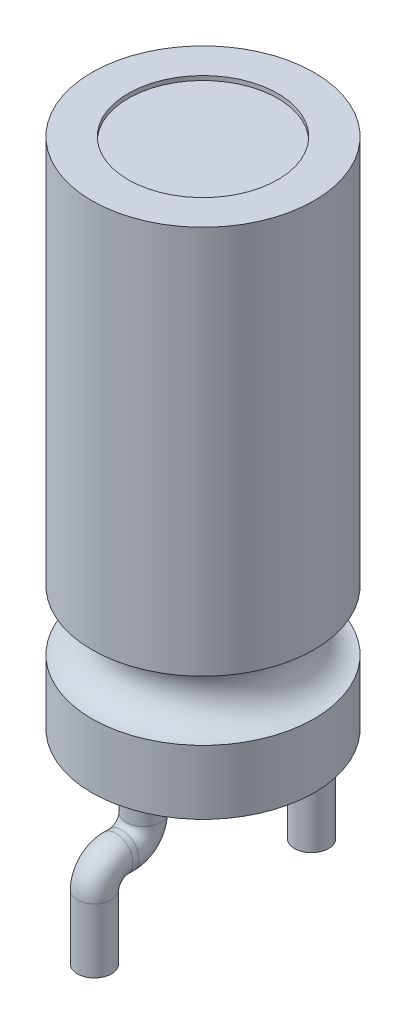
ISO-10303-21;
HEADER;
FILE_DESCRIPTION(('STEP AP214'),'2;1');
FILE_NAME('part.step','',(''),(''),'','','');
FILE_SCHEMA(('AUTOMOTIVE_DESIGN { 1 0 10303 214 1 1 1 1 }'));
ENDSEC;
DATA;
#1=APPLICATION_CONTEXT('core data for automotive mechanical design processes');
#2=APPLICATION_PROTOCOL_DEFINITION('international standard','automotive_design',2000,#1);
#3=PRODUCT_CONTEXT('',#1,'mechanical');
#4=PRODUCT('Part','Part','',(#3));
#5=PRODUCT_RELATED_PRODUCT_CATEGORY('part','',(#4));
#6=PRODUCT_DEFINITION_FORMATION('','',#4);
#7=PRODUCT_DEFINITION_CONTEXT('part definition',#1,'design');
#8=PRODUCT_DEFINITION('design','',#6,#7);
#9=PRODUCT_DEFINITION_SHAPE('','',#8);
#10=(LENGTH_UNIT() NAMED_UNIT(*) SI_UNIT(.MILLI.,.METRE.));
#11=(NAMED_UNIT(*) PLANE_ANGLE_UNIT() SI_UNIT($,.RADIAN.));
#12=(NAMED_UNIT(*) SI_UNIT($,.STERADIAN.) SOLID_ANGLE_UNIT());
#13=UNCERTAINTY_MEASURE_WITH_UNIT(LENGTH_MEASURE(1.E-05),#10,'distance_accuracy_value','');
#14=(GEOMETRIC_REPRESENTATION_CONTEXT(3) GLOBAL_UNCERTAINTY_ASSIGNED_CONTEXT((#13)) GLOBAL_UNIT_ASSIGNED_CONTEXT((#10,
#11,#12)) REPRESENTATION_CONTEXT('',''));
#15=CARTESIAN_POINT('',(0.,0.,0.));
#16=DIRECTION('',(0.,0.,1.));
#17=DIRECTION('',(1.,0.,0.));
#18=AXIS2_PLACEMENT_3D('',#15,#16,#17);
#19=CARTESIAN_POINT('',(2.6,27.5164236634825,0.));
#20=DIRECTION('',(0.,1.,0.));
#21=DIRECTION('',(0.,0.,1.));
#22=AXIS2_PLACEMENT_3D('',#19,#20,#21);
#23=PLANE('',#22);
#24=CARTESIAN_POINT('',(0.,27.5164236634825,1.4));
#25=DIRECTION('',(0.,-1.,0.));
#26=DIRECTION('',(0.,0.,-1.));
#27=AXIS2_PLACEMENT_3D('',#24,#25,#26);
#28=CIRCLE('',#27,0.4);
#29=CARTESIAN_POINT('',(0.,27.5164236634825,1.));
#30=VERTEX_POINT('',#29);
#31=EDGE_CURVE('E33',#30,#30,#28,.T.);
#32=ORIENTED_EDGE('',*,*,#31,.F.);
#33=EDGE_LOOP('',(#32));
#34=FACE_BOUND('',#33,.T.);
#35=CARTESIAN_POINT('',(0.,27.5164236634825,0.));
#36=DIRECTION('',(0.,1.,0.));
#37=DIRECTION('',(0.,0.,1.));
#38=AXIS2_PLACEMENT_3D('',#35,#36,#37);
#39=CIRCLE('',#38,2.6);
#40=CARTESIAN_POINT('',(0.,27.5164236634825,2.6));
#41=VERTEX_POINT('',#40);
#42=EDGE_CURVE('E29',#41,#41,#39,.T.);
#43=ORIENTED_EDGE('',*,*,#42,.F.);
#44=EDGE_LOOP('',(#43));
#45=FACE_BOUND('',#44,.T.);
#46=CARTESIAN_POINT('',(0.,27.5164236634825,-1.4));
#47=DIRECTION('',(0.,-1.,0.));
#48=DIRECTION('',(0.,0.,-1.));
#49=AXIS2_PLACEMENT_3D('',#46,#47,#48);
#50=CIRCLE('',#49,0.4);
#51=CARTESIAN_POINT('',(0.,27.5164236634825,-1.8));
#52=VERTEX_POINT('',#51);
#53=EDGE_CURVE('E10',#52,#52,#50,.T.);
#54=ORIENTED_EDGE('',*,*,#53,.F.);
#55=EDGE_LOOP('',(#54));
#56=FACE_BOUND('',#55,.T.);
#57=ADVANCED_FACE('F26',(#34,#45,#56),#23,.F.);
#58=CARTESIAN_POINT('',(0.,48.4017094017094,0.));
#59=DIRECTION('',(0.,1.,0.));
#60=DIRECTION('',(0.,0.,1.));
#61=AXIS2_PLACEMENT_3D('',#58,#59,#60);
#62=CYLINDRICAL_SURFACE('',#61,2.6);
#63=CARTESIAN_POINT('',(0.,29.0164236634825,0.));
#64=DIRECTION('',(0.,1.,0.));
#65=DIRECTION('',(0.,0.,1.));
#66=AXIS2_PLACEMENT_3D('',#63,#64,#65);
#67=CIRCLE('',#66,2.6);
#68=CARTESIAN_POINT('',(0.,29.0164236634825,2.6));
#69=VERTEX_POINT('',#68);
#70=EDGE_CURVE('E81',#69,#69,#67,.T.);
#71=ORIENTED_EDGE('',*,*,#70,.F.);
#72=EDGE_LOOP('',(#71));
#73=FACE_BOUND('',#72,.T.);
#74=ORIENTED_EDGE('',*,*,#42,.T.);
#75=EDGE_LOOP('',(#74));
#76=FACE_BOUND('',#75,.T.);
#77=ADVANCED_FACE('F88',(#73,#76),#62,.T.);
#78=CARTESIAN_POINT('',(0.,29.7164236634825,0.));
#79=DIRECTION('',(0.,1.,0.));
#80=DIRECTION('',(0.,0.,1.));
#81=AXIS2_PLACEMENT_3D('',#78,#79,#80);
#82=TOROIDAL_SURFACE('',#81,2.6,0.699999999999999);
#83=CARTESIAN_POINT('',(0.,30.4164236634825,0.));
#84=DIRECTION('',(0.,1.,0.));
#85=DIRECTION('',(0.,0.,1.));
#86=AXIS2_PLACEMENT_3D('',#83,#84,#85);
#87=CIRCLE('',#86,2.6);
#88=CARTESIAN_POINT('',(0.,30.4164236634825,2.6));
#89=VERTEX_POINT('',#88);
#90=EDGE_CURVE('E79',#89,#89,#87,.T.);
#91=ORIENTED_EDGE('',*,*,#90,.F.);
#92=EDGE_LOOP('',(#91));
#93=FACE_BOUND('',#92,.T.);
#94=ORIENTED_EDGE('',*,*,#70,.T.);
#95=EDGE_LOOP('',(#94));
#96=FACE_BOUND('',#95,.T.);
#97=ADVANCED_FACE('F96',(#93,#96),#82,.F.);
#98=CARTESIAN_POINT('',(0.,48.4017094017094,0.));
#99=DIRECTION('',(0.,1.,0.));
#100=DIRECTION('',(0.,0.,1.));
#101=AXIS2_PLACEMENT_3D('',#98,#99,#100);
#102=CYLINDRICAL_SURFACE('',#101,2.6);
#103=CARTESIAN_POINT('',(0.,39.5164236634825,0.));
#104=DIRECTION('',(0.,1.,0.));
#105=DIRECTION('',(0.,0.,1.));
#106=AXIS2_PLACEMENT_3D('',#103,#104,#105);
#107=CIRCLE('',#106,2.6);
#108=CARTESIAN_POINT('',(0.,39.5164236634825,2.6));
#109=VERTEX_POINT('',#108);
#110=EDGE_CURVE('E76',#109,#109,#107,.T.);
#111=ORIENTED_EDGE('',*,*,#110,.F.);
#112=EDGE_LOOP('',(#111));
#113=FACE_BOUND('',#112,.T.);
#114=ORIENTED_EDGE('',*,*,#90,.T.);
#115=EDGE_LOOP('',(#114));
#116=FACE_BOUND('',#115,.T.);
#117=ADVANCED_FACE('F141',(#113,#116),#102,.T.);
#118=CARTESIAN_POINT('',(0.,39.5164236634825,0.));
#119=DIRECTION('',(0.,-1.,0.));
#120=DIRECTION('',(0.,0.,-1.));
#121=AXIS2_PLACEMENT_3D('',#118,#119,#120);
#122=PLANE('',#121);
#123=CARTESIAN_POINT('',(0.,39.5164236634825,0.));
#124=DIRECTION('',(0.,1.,0.));
#125=DIRECTION('',(0.,0.,1.));
#126=AXIS2_PLACEMENT_3D('',#123,#124,#125);
#127=CIRCLE('',#126,1.75);
#128=CARTESIAN_POINT('',(0.,39.5164236634825,1.75));
#129=VERTEX_POINT('',#128);
#130=EDGE_CURVE('E70',#129,#129,#127,.T.);
#131=ORIENTED_EDGE('',*,*,#130,.F.);
#132=EDGE_LOOP('',(#131));
#133=FACE_BOUND('',#132,.T.);
#134=ORIENTED_EDGE('',*,*,#110,.T.);
#135=EDGE_LOOP('',(#134));
#136=FACE_BOUND('',#135,.T.);
#137=ADVANCED_FACE('F137',(#133,#136),#122,.F.);
#138=CARTESIAN_POINT('',(0.,39.4164236634825,0.));
#139=DIRECTION('',(0.,1.,0.));
#140=DIRECTION('',(0.,0.,1.));
#141=AXIS2_PLACEMENT_3D('',#138,#139,#140);
#142=CYLINDRICAL_SURFACE('',#141,1.75);
#143=CARTESIAN_POINT('',(0.,39.4164236634825,0.));
#144=DIRECTION('',(0.,1.,0.));
#145=DIRECTION('',(0.,0.,1.));
#146=AXIS2_PLACEMENT_3D('',#143,#144,#145);
#147=CIRCLE('',#146,1.75);
#148=CARTESIAN_POINT('',(0.,39.4164236634825,1.75));
#149=VERTEX_POINT('',#148);
#150=EDGE_CURVE('E73',#149,#149,#147,.T.);
#151=ORIENTED_EDGE('',*,*,#150,.F.);
#152=EDGE_LOOP('',(#151));
#153=FACE_BOUND('',#152,.T.);
#154=ORIENTED_EDGE('',*,*,#130,.T.);
#155=EDGE_LOOP('',(#154));
#156=FACE_BOUND('',#155,.T.);
#157=ADVANCED_FACE('F133',(#153,#156),#142,.F.);
#158=CARTESIAN_POINT('',(0.,39.4164236634825,0.));
#159=DIRECTION('',(0.,1.,0.));
#160=DIRECTION('',(0.,0.,1.));
#161=AXIS2_PLACEMENT_3D('',#158,#159,#160);
#162=PLANE('',#161);
#163=ORIENTED_EDGE('',*,*,#150,.T.);
#164=EDGE_LOOP('',(#163));
#165=FACE_BOUND('',#164,.T.);
#166=ADVANCED_FACE('F129',(#165),#162,.T.);
#167=CARTESIAN_POINT('',(0.,25.5164236634825,2.54));
#168=DIRECTION('',(0.,-1.,0.));
#169=DIRECTION('',(0.,0.,-1.));
#170=AXIS2_PLACEMENT_3D('',#167,#168,#169);
#171=CYLINDRICAL_SURFACE('',#170,0.4);
#172=CARTESIAN_POINT('',(0.,25.5164236634825,2.54));
#173=DIRECTION('',(0.,-1.,0.));
#174=DIRECTION('',(0.,0.,-1.));
#175=AXIS2_PLACEMENT_3D('',#172,#173,#174);
#176=CIRCLE('',#175,0.4);
#177=CARTESIAN_POINT('',(0.,25.5164236634825,2.94));
#178=VERTEX_POINT('',#177);
#179=EDGE_CURVE('E64',#178,#178,#176,.T.);
#180=ORIENTED_EDGE('',*,*,#179,.T.);
#181=EDGE_LOOP('',(#180));
#182=FACE_BOUND('',#181,.T.);
#183=CARTESIAN_POINT('',(0.,24.0164236634825,2.54));
#184=DIRECTION('',(0.,-1.,0.));
#185=DIRECTION('',(0.,0.,-1.));
#186=AXIS2_PLACEMENT_3D('',#183,#184,#185);
#187=CIRCLE('',#186,0.4);
#188=CARTESIAN_POINT('',(0.,24.0164236634825,2.14));
#189=VERTEX_POINT('',#188);
#190=EDGE_CURVE('E67',#189,#189,#187,.T.);
#191=ORIENTED_EDGE('',*,*,#190,.F.);
#192=EDGE_LOOP('',(#191));
#193=FACE_BOUND('',#192,.T.);
#194=ADVANCED_FACE('F125',(#182,#193),#171,.T.);
#195=CARTESIAN_POINT('',(0.,25.5164236634825,2.04));
#196=DIRECTION('',(1.,0.,0.));
#197=DIRECTION('',(0.,0.,-1.));
#198=AXIS2_PLACEMENT_3D('',#195,#196,#197);
#199=TOROIDAL_SURFACE('',#198,0.500000000000004,0.4);
#200=CARTESIAN_POINT('',(0.,26.0164236634825,2.04));
#201=DIRECTION('',(0.,0.,1.));
#202=DIRECTION('',(0.,-1.,0.));
#203=AXIS2_PLACEMENT_3D('',#200,#201,#202);
#204=CIRCLE('',#203,0.4);
#205=CARTESIAN_POINT('',(0.,26.4164236634825,2.03999999999999));
#206=VERTEX_POINT('',#205);
#207=EDGE_CURVE('E61',#206,#206,#204,.T.);
#208=CARTESIAN_POINT('',(0.,25.5164236634825,2.04));
#209=DIRECTION('',(1.,0.,0.));
#210=DIRECTION('',(0.,0.,-1.));
#211=AXIS2_PLACEMENT_3D('',#208,#209,#210);
#212=CIRCLE('',#211,0.900000000000004);
#213=EDGE_CURVE('',#206,#178,#212,.T.);
#214=ORIENTED_EDGE('',*,*,#207,.T.);
#215=ORIENTED_EDGE('',*,*,#179,.F.);
#216=ORIENTED_EDGE('',*,*,#213,.T.);
#217=ORIENTED_EDGE('',*,*,#213,.F.);
#218=EDGE_LOOP('',(#214,#216,#215,#217));
#219=FACE_BOUND('',#218,.T.);
#220=ADVANCED_FACE('F121',(#219),#199,.T.);
#221=CARTESIAN_POINT('',(0.,26.0164236634825,1.90000000000003));
#222=DIRECTION('',(0.,0.,1.));
#223=DIRECTION('',(1.,0.,0.));
#224=AXIS2_PLACEMENT_3D('',#221,#222,#223);
#225=CYLINDRICAL_SURFACE('',#224,0.4);
#226=CARTESIAN_POINT('',(0.,26.0164236634825,1.90000000000003));
#227=DIRECTION('',(0.,0.,1.));
#228=DIRECTION('',(0.,-1.,0.));
#229=AXIS2_PLACEMENT_3D('',#226,#227,#228);
#230=CIRCLE('',#229,0.4);
#231=CARTESIAN_POINT('',(0.,25.6164236634825,1.90000000000005));
#232=VERTEX_POINT('',#231);
#233=EDGE_CURVE('E58',#232,#232,#230,.T.);
#234=ORIENTED_EDGE('',*,*,#233,.T.);
#235=EDGE_LOOP('',(#234));
#236=FACE_BOUND('',#235,.T.);
#237=ORIENTED_EDGE('',*,*,#207,.F.);
#238=EDGE_LOOP('',(#237));
#239=FACE_BOUND('',#238,.T.);
#240=ADVANCED_FACE('F113',(#236,#239),#225,.T.);
#241=CARTESIAN_POINT('',(0.,26.5164236634825,1.9));
#242=DIRECTION('',(-1.,0.,0.));
#243=DIRECTION('',(0.,0.,1.));
#244=AXIS2_PLACEMENT_3D('',#241,#242,#243);
#245=TOROIDAL_SURFACE('',#244,0.5,0.4);
#246=CARTESIAN_POINT('',(0.,26.5164236634825,1.4));
#247=DIRECTION('',(0.,-1.,0.));
#248=DIRECTION('',(0.,0.,-1.));
#249=AXIS2_PLACEMENT_3D('',#246,#247,#248);
#250=CIRCLE('',#249,0.4);
#251=CARTESIAN_POINT('',(0.,26.5164236634825,1.));
#252=VERTEX_POINT('',#251);
#253=EDGE_CURVE('E54',#252,#252,#250,.T.);
#254=CARTESIAN_POINT('',(0.,26.5164236634825,1.9));
#255=DIRECTION('',(-1.,0.,0.));
#256=DIRECTION('',(0.,0.,1.));
#257=AXIS2_PLACEMENT_3D('',#254,#255,#256);
#258=CIRCLE('',#257,0.9);
#259=EDGE_CURVE('',#252,#232,#258,.T.);
#260=ORIENTED_EDGE('',*,*,#253,.T.);
#261=ORIENTED_EDGE('',*,*,#233,.F.);
#262=ORIENTED_EDGE('',*,*,#259,.T.);
#263=ORIENTED_EDGE('',*,*,#259,.F.);
#264=EDGE_LOOP('',(#260,#262,#261,#263));
#265=FACE_BOUND('',#264,.T.);
#266=ADVANCED_FACE('F103',(#265),#245,.T.);
#267=CARTESIAN_POINT('',(0.,26.5164236634825,1.4));
#268=DIRECTION('',(0.,1.,0.));
#269=DIRECTION('',(0.,0.,1.));
#270=AXIS2_PLACEMENT_3D('',#267,#268,#269);
#271=CYLINDRICAL_SURFACE('',#270,0.4);
#272=ORIENTED_EDGE('',*,*,#253,.F.);
#273=EDGE_LOOP('',(#272));
#274=FACE_BOUND('',#273,.T.);
#275=ORIENTED_EDGE('',*,*,#31,.T.);
#276=EDGE_LOOP('',(#275));
#277=FACE_BOUND('',#276,.T.);
#278=ADVANCED_FACE('F100',(#274,#277),#271,.T.);
#279=CARTESIAN_POINT('',(0.,24.0164236634825,2.54));
#280=DIRECTION('',(0.,-1.,0.));
#281=DIRECTION('',(0.,0.,-1.));
#282=AXIS2_PLACEMENT_3D('',#279,#280,#281);
#283=PLANE('',#282);
#284=ORIENTED_EDGE('',*,*,#190,.T.);
#285=EDGE_LOOP('',(#284));
#286=FACE_BOUND('',#285,.T.);
#287=ADVANCED_FACE('F102',(#286),#283,.T.);
#288=CARTESIAN_POINT('',(0.,25.5164236634825,-2.54));
#289=DIRECTION('',(0.,-1.,0.));
#290=DIRECTION('',(0.,0.,-1.));
#291=AXIS2_PLACEMENT_3D('',#288,#289,#290);
#292=CYLINDRICAL_SURFACE('',#291,0.4);
#293=CARTESIAN_POINT('',(0.,25.5164236634825,-2.54));
#294=DIRECTION('',(0.,-1.,0.));
#295=DIRECTION('',(0.,0.,-1.));
#296=AXIS2_PLACEMENT_3D('',#293,#294,#295);
#297=CIRCLE('',#296,0.4);
#298=CARTESIAN_POINT('',(0.,25.5164236634825,-2.94));
#299=VERTEX_POINT('',#298);
#300=EDGE_CURVE('E49',#299,#299,#297,.T.);
#301=ORIENTED_EDGE('',*,*,#300,.T.);
#302=EDGE_LOOP('',(#301));
#303=FACE_BOUND('',#302,.T.);
#304=CARTESIAN_POINT('',(0.,24.0164236634825,-2.54));
#305=DIRECTION('',(0.,-1.,0.));
#306=DIRECTION('',(0.,0.,-1.));
#307=AXIS2_PLACEMENT_3D('',#304,#305,#306);
#308=CIRCLE('',#307,0.4);
#309=CARTESIAN_POINT('',(0.,24.0164236634825,-2.94));
#310=VERTEX_POINT('',#309);
#311=EDGE_CURVE('E52',#310,#310,#308,.T.);
#312=ORIENTED_EDGE('',*,*,#311,.F.);
#313=EDGE_LOOP('',(#312));
#314=FACE_BOUND('',#313,.T.);
#315=ADVANCED_FACE('F110',(#303,#314),#292,.T.);
#316=CARTESIAN_POINT('',(0.,25.5164236634825,-2.04));
#317=DIRECTION('',(-1.,0.,0.));
#318=DIRECTION('',(0.,0.,1.));
#319=AXIS2_PLACEMENT_3D('',#316,#317,#318);
#320=TOROIDAL_SURFACE('',#319,0.500000000000004,0.4);
#321=CARTESIAN_POINT('',(0.,26.0164236634825,-2.03999999999999));
#322=DIRECTION('',(0.,0.,-1.));
#323=DIRECTION('',(0.,1.,0.));
#324=AXIS2_PLACEMENT_3D('',#321,#322,#323);
#325=CIRCLE('',#324,0.4);
#326=CARTESIAN_POINT('',(0.,26.4164236634825,-2.03999999999999));
#327=VERTEX_POINT('',#326);
#328=EDGE_CURVE('E46',#327,#327,#325,.T.);
#329=CARTESIAN_POINT('',(0.,25.5164236634825,-2.04));
#330=DIRECTION('',(-1.,0.,0.));
#331=DIRECTION('',(0.,0.,1.));
#332=AXIS2_PLACEMENT_3D('',#329,#330,#331);
#333=CIRCLE('',#332,0.900000000000004);
#334=EDGE_CURVE('',#327,#299,#333,.T.);
#335=ORIENTED_EDGE('',*,*,#328,.T.);
#336=ORIENTED_EDGE('',*,*,#300,.F.);
#337=ORIENTED_EDGE('',*,*,#334,.T.);
#338=ORIENTED_EDGE('',*,*,#334,.F.);
#339=EDGE_LOOP('',(#335,#337,#336,#338));
#340=FACE_BOUND('',#339,.T.);
#341=ADVANCED_FACE('F201',(#340),#320,.T.);
#342=CARTESIAN_POINT('',(0.,26.0164236634825,-1.9));
#343=DIRECTION('',(0.,0.,-1.));
#344=DIRECTION('',(-1.,0.,0.));
#345=AXIS2_PLACEMENT_3D('',#342,#343,#344);
#346=CYLINDRICAL_SURFACE('',#345,0.4);
#347=CARTESIAN_POINT('',(0.,26.0164236634825,-1.9));
#348=DIRECTION('',(0.,0.,-1.));
#349=DIRECTION('',(0.,1.,0.));
#350=AXIS2_PLACEMENT_3D('',#347,#348,#349);
#351=CIRCLE('',#350,0.4);
#352=CARTESIAN_POINT('',(0.,25.6164236634825,-1.9));
#353=VERTEX_POINT('',#352);
#354=EDGE_CURVE('E43',#353,#353,#351,.T.);
#355=ORIENTED_EDGE('',*,*,#354,.T.);
#356=EDGE_LOOP('',(#355));
#357=FACE_BOUND('',#356,.T.);
#358=ORIENTED_EDGE('',*,*,#328,.F.);
#359=EDGE_LOOP('',(#358));
#360=FACE_BOUND('',#359,.T.);
#361=ADVANCED_FACE('F208',(#357,#360),#346,.T.);
#362=CARTESIAN_POINT('',(0.,26.5164236634825,-1.9));
#363=DIRECTION('',(1.,0.,0.));
#364=DIRECTION('',(0.,0.,-1.));
#365=AXIS2_PLACEMENT_3D('',#362,#363,#364);
#366=TOROIDAL_SURFACE('',#365,0.5,0.4);
#367=CARTESIAN_POINT('',(0.,26.5164236634825,-1.4));
#368=DIRECTION('',(0.,-1.,0.));
#369=DIRECTION('',(0.,0.,-1.));
#370=AXIS2_PLACEMENT_3D('',#367,#368,#369);
#371=CIRCLE('',#370,0.4);
#372=CARTESIAN_POINT('',(0.,26.5164236634825,-0.999999999999999));
#373=VERTEX_POINT('',#372);
#374=EDGE_CURVE('E40',#373,#373,#371,.T.);
#375=CARTESIAN_POINT('',(0.,26.5164236634825,-1.9));
#376=DIRECTION('',(1.,0.,0.));
#377=DIRECTION('',(0.,0.,-1.));
#378=AXIS2_PLACEMENT_3D('',#375,#376,#377);
#379=CIRCLE('',#378,0.9);
#380=EDGE_CURVE('',#373,#353,#379,.T.);
#381=ORIENTED_EDGE('',*,*,#374,.T.);
#382=ORIENTED_EDGE('',*,*,#354,.F.);
#383=ORIENTED_EDGE('',*,*,#380,.T.);
#384=ORIENTED_EDGE('',*,*,#380,.F.);
#385=EDGE_LOOP('',(#381,#383,#382,#384));
#386=FACE_BOUND('',#385,.T.);
#387=ADVANCED_FACE('F216',(#386),#366,.T.);
#388=CARTESIAN_POINT('',(0.,26.5164236634825,-1.4));
#389=DIRECTION('',(0.,1.,0.));
#390=DIRECTION('',(0.,0.,1.));
#391=AXIS2_PLACEMENT_3D('',#388,#389,#390);
#392=CYLINDRICAL_SURFACE('',#391,0.4);
#393=ORIENTED_EDGE('',*,*,#374,.F.);
#394=EDGE_LOOP('',(#393));
#395=FACE_BOUND('',#394,.T.);
#396=ORIENTED_EDGE('',*,*,#53,.T.);
#397=EDGE_LOOP('',(#396));
#398=FACE_BOUND('',#397,.T.);
#399=ADVANCED_FACE('F224',(#395,#398),#392,.T.);
#400=CARTESIAN_POINT('',(0.,24.0164236634825,-2.54));
#401=DIRECTION('',(0.,-1.,0.));
#402=DIRECTION('',(0.,0.,-1.));
#403=AXIS2_PLACEMENT_3D('',#400,#401,#402);
#404=PLANE('',#403);
#405=ORIENTED_EDGE('',*,*,#311,.T.);
#406=EDGE_LOOP('',(#405));
#407=FACE_BOUND('',#406,.T.);
#408=ADVANCED_FACE('F232',(#407),#404,.T.);
#409=CLOSED_SHELL('',(#57,#77,#97,#117,#137,#157,#166,#194,#220,#240,#266,#278,#287,#315,#341,
#361,#387,#399,#408));
#410=MANIFOLD_SOLID_BREP('B2',#409);
#411=ADVANCED_BREP_SHAPE_REPRESENTATION('',(#18,#410),#14);
#412=SHAPE_DEFINITION_REPRESENTATION(#9,#411);
ENDSEC;
END-ISO-10303-21;
